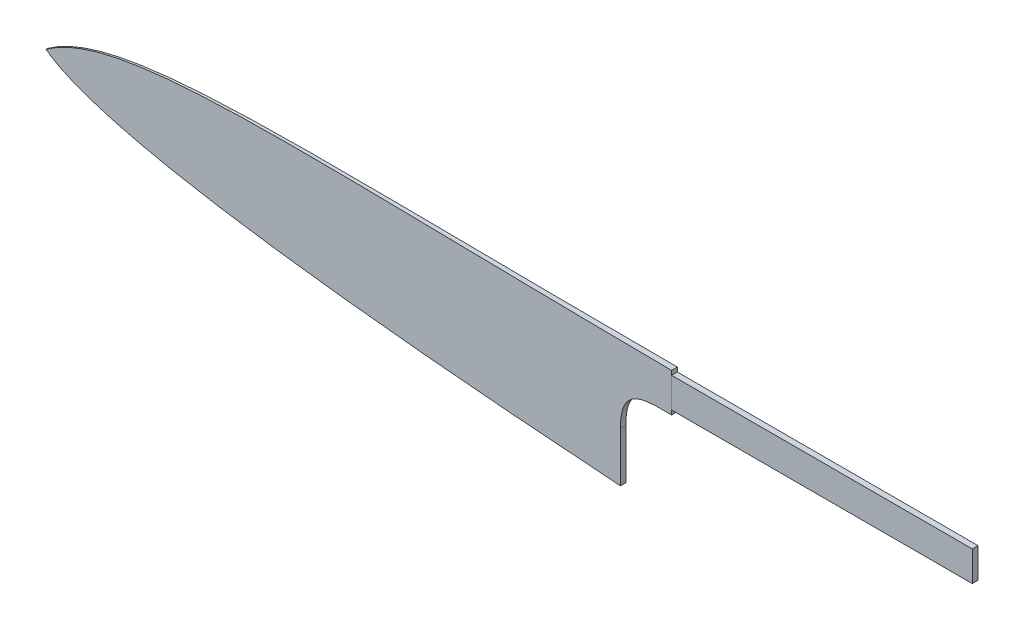
ISO-10303-21;
HEADER;
FILE_DESCRIPTION(('STEP AP214'),'2;1');
FILE_NAME('part.step','',(''),(''),'','','');
FILE_SCHEMA(('AUTOMOTIVE_DESIGN { 1 0 10303 214 1 1 1 1 }'));
ENDSEC;
DATA;
#1=APPLICATION_CONTEXT('core data for automotive mechanical design processes');
#2=APPLICATION_PROTOCOL_DEFINITION('international standard','automotive_design',2000,#1);
#3=PRODUCT_CONTEXT('',#1,'mechanical');
#4=PRODUCT('Part','Part','',(#3));
#5=PRODUCT_RELATED_PRODUCT_CATEGORY('part','',(#4));
#6=PRODUCT_DEFINITION_FORMATION('','',#4);
#7=PRODUCT_DEFINITION_CONTEXT('part definition',#1,'design');
#8=PRODUCT_DEFINITION('design','',#6,#7);
#9=PRODUCT_DEFINITION_SHAPE('','',#8);
#10=(LENGTH_UNIT() NAMED_UNIT(*) SI_UNIT(.MILLI.,.METRE.));
#11=(NAMED_UNIT(*) PLANE_ANGLE_UNIT() SI_UNIT($,.RADIAN.));
#12=(NAMED_UNIT(*) SI_UNIT($,.STERADIAN.) SOLID_ANGLE_UNIT());
#13=UNCERTAINTY_MEASURE_WITH_UNIT(LENGTH_MEASURE(1.E-05),#10,'distance_accuracy_value','');
#14=(GEOMETRIC_REPRESENTATION_CONTEXT(3) GLOBAL_UNCERTAINTY_ASSIGNED_CONTEXT((#13)) GLOBAL_UNIT_ASSIGNED_CONTEXT((#10,
#11,#12)) REPRESENTATION_CONTEXT('',''));
#15=CARTESIAN_POINT('',(0.,0.,0.));
#16=DIRECTION('',(0.,0.,1.));
#17=DIRECTION('',(1.,0.,0.));
#18=AXIS2_PLACEMENT_3D('',#15,#16,#17);
#19=CARTESIAN_POINT('',(0.,52.,0.500000000000042));
#20=DIRECTION('',(0.0068180233432412,0.,-0.999976757008727));
#21=DIRECTION('',(-0.999976757008727,0.,-0.0068180233432412));
#22=AXIS2_PLACEMENT_3D('',#19,#20,#21);
#23=PLANE('',#22);
#24=CARTESIAN_POINT('',(220.,34.5,2.00000000000002));
#25=CARTESIAN_POINT('',(219.705943450654,34.4999900263377,1.99799506898174));
#26=CARTESIAN_POINT('',(219.411887124813,34.5003581419151,1.99599013948738));
#27=CARTESIAN_POINT('',(218.823474040931,34.5010436281228,1.99197823209727));
#28=CARTESIAN_POINT('',(218.529117282854,34.50136094653,1.98997125420129));
#29=CARTESIAN_POINT('',(217.940222914986,34.501134564733,1.98595606532946));
#30=CARTESIAN_POINT('',(217.645685304876,34.5005903369271,1.98394785435144));
#31=CARTESIAN_POINT('',(217.056548702735,34.4977408189894,1.9799310138823));
#32=CARTESIAN_POINT('',(216.761949712249,34.4954351218858,1.97792238440171));
#33=CARTESIAN_POINT('',(216.166333686134,34.4879945398922,1.97386136604184));
#34=CARTESIAN_POINT('',(215.865317336315,34.4827988233492,1.97180898183853));
#35=CARTESIAN_POINT('',(215.263458904218,34.4683594578574,1.96770540161969));
#36=CARTESIAN_POINT('',(214.962616796778,34.4591169241271,1.96565420543259));
#37=CARTESIAN_POINT('',(214.361233504333,34.4352507816667,1.96155386480228));
#38=CARTESIAN_POINT('',(214.060692254255,34.4206288753846,1.95950471991539));
#39=CARTESIAN_POINT('',(213.460039491407,34.3844753084658,1.9554093601687));
#40=CARTESIAN_POINT('',(213.159927940106,34.362944312177,1.95336314504619));
#41=CARTESIAN_POINT('',(212.610765905609,34.3155438966368,1.94961885844735));
#42=CARTESIAN_POINT('',(212.361601654465,34.2910096608983,1.94792001128046));
#43=CARTESIAN_POINT('',(211.864049243434,34.2347573008229,1.94452760847797));
#44=CARTESIAN_POINT('',(211.615661157084,34.2030385155315,1.94283405334377));
#45=CARTESIAN_POINT('',(211.120030527538,34.1310927779367,1.93945475359687));
#46=CARTESIAN_POINT('',(210.872788334436,34.0908633807092,1.93776901137117));
#47=CARTESIAN_POINT('',(210.381343824899,34.0006528922389,1.9344182533516));
#48=CARTESIAN_POINT('',(210.137132492368,33.950721525294,1.93275317608434));
#49=CARTESIAN_POINT('',(209.651358543768,33.8393922670979,1.92944108098025));
#50=CARTESIAN_POINT('',(209.409795414744,33.7779966395478,1.927794059646));
#51=CARTESIAN_POINT('',(208.930466427999,33.6420514190386,1.92452590746364));
#52=CARTESIAN_POINT('',(208.692699065322,33.5675071880103,1.92290476635448));
#53=CARTESIAN_POINT('',(208.223566728578,33.4039496944126,1.91970613678577));
#54=CARTESIAN_POINT('',(207.992174396648,33.3150156215203,1.91812846179535));
#55=CARTESIAN_POINT('',(207.536314508856,33.120812461045,1.91502032619676));
#56=CARTESIAN_POINT('',(207.311846394438,33.0155446952003,1.91348986178028));
#57=CARTESIAN_POINT('',(206.872302988629,32.7875573409566,1.91049297492248));
#58=CARTESIAN_POINT('',(206.657214684714,32.6648630046813,1.90902646375943));
#59=CARTESIAN_POINT('',(206.238494373407,32.4012115673991,1.90617155254598));
#60=CARTESIAN_POINT('',(206.034861933933,32.2602551558483,1.90478314954957));
#61=CARTESIAN_POINT('',(205.639698694761,31.9588376679743,1.90208885473703));
#62=CARTESIAN_POINT('',(205.448289958908,31.7982160832599,1.90078379517439));
#63=CARTESIAN_POINT('',(205.081649347262,31.4594656025268,1.89828397282226));
#64=CARTESIAN_POINT('',(204.906417104598,31.2813371037414,1.89708920753137));
#65=CARTESIAN_POINT('',(204.573481959898,30.9092952471037,1.89481919518114));
#66=CARTESIAN_POINT('',(204.415785426408,30.7153761985079,1.89374399154371));
#67=CARTESIAN_POINT('',(204.118555127804,30.3141042786515,1.89171742132595));
#68=CARTESIAN_POINT('',(203.979023816677,30.106749597991,1.89076607147736));
#69=CARTESIAN_POINT('',(203.692505499547,29.6396514306856,1.88881253749693));
#70=CARTESIAN_POINT('',(203.549346821812,29.3775625744421,1.88783645560328));
#71=CARTESIAN_POINT('',(203.287108280717,28.8416388204328,1.88604846555036));
#72=CARTESIAN_POINT('',(203.168035723706,28.5678003889604,1.8852366072071));
#73=CARTESIAN_POINT('',(202.951027286145,28.009830378534,1.88375700422373));
#74=CARTESIAN_POINT('',(202.85323926827,27.7256418658249,1.88309026773822));
#75=CARTESIAN_POINT('',(202.677324665967,27.1513468019386,1.88189084999525));
#76=CARTESIAN_POINT('',(202.599196162811,26.8612408312827,1.88135815565556));
#77=CARTESIAN_POINT('',(202.461419937903,26.2823022704362,1.88041877230392));
#78=CARTESIAN_POINT('',(202.401461780621,25.9935425783977,1.88000996668607));
#79=CARTESIAN_POINT('',(202.296030126808,25.4132967515089,1.87929111450097));
#80=CARTESIAN_POINT('',(202.250562899882,25.1218094925474,1.87898111068103));
#81=CARTESIAN_POINT('',(202.172287972169,24.5369566711788,1.87844741799208));
#82=CARTESIAN_POINT('',(202.139489233042,24.2435899278193,1.8782237902253));
#83=CARTESIAN_POINT('',(202.085661531322,23.6627601879368,1.87785678316812));
#84=CARTESIAN_POINT('',(202.064373740822,23.3753207362962,1.87771163914198));
#85=CARTESIAN_POINT('',(202.031159401762,22.8001683738834,1.8774851777393));
#86=CARTESIAN_POINT('',(202.019224723884,22.5124559186792,1.87740380493559));
#87=CARTESIAN_POINT('',(202.003668926905,21.9374958000225,1.87729774268346));
#88=CARTESIAN_POINT('',(202.000027827363,21.650248689058,1.87727291700476));
#89=CARTESIAN_POINT('',(202.,21.3630331505771,1.87727272727274));
#90=B_SPLINE_CURVE_WITH_KNOTS('',3,(#24,#25,#26,#27,#28,#29,#30,#31,#32,#33,#34,#35,#36,#37,#38,
#39,#40,#41,#42,#43,#44,#45,#46,#47,#48,#49,#50,#51,#52,#53,#54,#55,#56,#57,#58,#59,#60,#61,#62,
#63,#64,#65,#66,#67,#68,#69,#70,#71,#72,#73,#74,#75,#76,#77,#78,#79,#80,#81,#82,#83,#84,#85,#86,
#87,#88,#89),.UNSPECIFIED.,.F.,.F.,(4,2,2,2,2,2,2,2,2,2,2,2,2,2,2,2,2,2,2,2,2,2,2,2,2,2,2,2,2,2,
2,2,4),(0.,0.882190002111462,1.76528121380216,2.64891343039098,3.53274986409533,4.435935277913,
5.33887194916582,6.24152310716143,7.14408749617821,7.8951273433212,8.64623631170646,
9.39756135201356,10.1451327200139,10.8925566304494,11.6396764470901,12.3828164636837,
13.1258963759974,13.8679103039605,14.6098962265084,15.358402168448,16.1068911306458,
16.8556510442823,17.6045120051455,18.4990257277843,19.3938103891184,20.2946255959574,
21.1953528510166,22.0796889094848,22.9644070644684,23.8497499258287,24.7142568217189,
25.5780114898632,26.4396830359918),.UNSPECIFIED.);
#91=CARTESIAN_POINT('',(220.,34.5,2.00000000000001));
#92=VERTEX_POINT('',#91);
#93=CARTESIAN_POINT('',(202.,21.3630331505771,1.87727272727273));
#94=VERTEX_POINT('',#93);
#95=EDGE_CURVE('E106',#92,#94,#90,.T.);
#96=ORIENTED_EDGE('',*,*,#95,.F.);
#97=DIRECTION('',(0.,1.,0.));
#98=VECTOR('',#97,1.);
#99=CARTESIAN_POINT('',(220.,36.,2.00000000000001));
#100=LINE('',#99,#98);
#101=CARTESIAN_POINT('',(220.,36.,2.00000000000001));
#102=VERTEX_POINT('',#101);
#103=EDGE_CURVE('E116',#92,#102,#100,.T.);
#104=ORIENTED_EDGE('',*,*,#103,.T.);
#105=DIRECTION('',(0.,-1.,0.));
#106=VECTOR('',#105,1.);
#107=CARTESIAN_POINT('',(220.,52.,2.00000000000001));
#108=LINE('',#107,#106);
#109=CARTESIAN_POINT('',(220.,46.5,2.00000000000001));
#110=VERTEX_POINT('',#109);
#111=EDGE_CURVE('E226',#110,#102,#108,.T.);
#112=ORIENTED_EDGE('',*,*,#111,.F.);
#113=DIRECTION('',(0.,1.,0.));
#114=VECTOR('',#113,1.);
#115=CARTESIAN_POINT('',(220.,46.5,2.00000000000001));
#116=LINE('',#115,#114);
#117=CARTESIAN_POINT('',(220.,48.,2.00000000000001));
#118=VERTEX_POINT('',#117);
#119=EDGE_CURVE('E124',#110,#118,#116,.T.);
#120=ORIENTED_EDGE('',*,*,#119,.T.);
#121=CARTESIAN_POINT('',(0.,34.3739398129274,0.500000000000042));
#122=CARTESIAN_POINT('',(0.524867259545,34.7554897413912,0.50357864040603));
#123=CARTESIAN_POINT('',(1.0589926230277,35.1241443307954,0.507220404247958));
#124=CARTESIAN_POINT('',(2.1408711121908,35.834641114132,0.514596848492251));
#125=CARTESIAN_POINT('',(2.68853992825894,36.1766115664871,0.518330954056352));
#126=CARTESIAN_POINT('',(3.79621750407102,36.8355308468651,0.525883301164162));
#127=CARTESIAN_POINT('',(4.35617911579209,37.1525591805863,0.529701221244078));
#128=CARTESIAN_POINT('',(5.4872447810945,37.7633628612964,0.537413032598413));
#129=CARTESIAN_POINT('',(6.05832564947798,38.0571812330182,0.541306765791936));
#130=CARTESIAN_POINT('',(7.21048882342137,38.6232050261574,0.549162423796095));
#131=CARTESIAN_POINT('',(7.79156249683609,38.8954280633496,0.553124289751196));
#132=CARTESIAN_POINT('',(8.96263238916208,39.4198015792233,0.561108857198873));
#133=CARTESIAN_POINT('',(9.55262805423056,39.6719532978176,0.565131554915249));
#134=CARTESIAN_POINT('',(10.7309091328242,40.1536910943395,0.573165289542024));
#135=CARTESIAN_POINT('',(11.3190751401674,40.3835700203211,0.577175512319363));
#136=CARTESIAN_POINT('',(12.5021702060925,40.8265786835943,0.585242069587035));
#137=CARTESIAN_POINT('',(13.0971040122039,41.0396957119996,0.589298436446885));
#138=CARTESIAN_POINT('',(14.2928303011874,41.4503546236946,0.597451115689954));
#139=CARTESIAN_POINT('',(14.8936270042411,41.6478841887827,0.601547456847138));
#140=CARTESIAN_POINT('',(16.1002016482384,42.0284576170252,0.60977410214712));
#141=CARTESIAN_POINT('',(16.7059825260667,42.211492145988,0.613904426314131));
#142=CARTESIAN_POINT('',(17.9216735473252,42.5640878292805,0.622193228731802));
#143=CARTESIAN_POINT('',(18.531585057383,42.7336442616823,0.626351716300377));
#144=CARTESIAN_POINT('',(19.7547026582445,43.0602199735409,0.634691154488071));
#145=CARTESIAN_POINT('',(20.3679085394142,43.2172400408837,0.638872103677866));
#146=CARTESIAN_POINT('',(21.9584658159616,43.6086149512296,0.6497168123816));
#147=CARTESIAN_POINT('',(22.9379873665342,43.834173392118,0.656395368408228));
#148=CARTESIAN_POINT('',(24.9026337872248,44.2595726065643,0.669790684912934));
#149=CARTESIAN_POINT('',(25.887759095975,44.4594113371716,0.676507448381686));
#150=CARTESIAN_POINT('',(27.8621337748799,44.8363187614828,0.689969093919674));
#151=CARTESIAN_POINT('',(28.8513822848155,45.0133919811171,0.69671397012378));
#152=CARTESIAN_POINT('',(30.8332255995135,45.3474324034732,0.710226538178539));
#153=CARTESIAN_POINT('',(31.8258203255164,45.5044000760721,0.716994229492195));
#154=CARTESIAN_POINT('',(33.8146416279079,45.8006671791662,0.730554374735773));
#155=CARTESIAN_POINT('',(34.8108708386328,45.939948838076,0.737346846627079));
#156=CARTESIAN_POINT('',(36.8054121873724,46.2026596482989,0.750945992186667));
#157=CARTESIAN_POINT('',(37.8037243363272,46.3260887161369,0.75775266592954));
#158=CARTESIAN_POINT('',(39.8030669424519,46.5589640701398,0.771384547334936));
#159=CARTESIAN_POINT('',(40.8040991730638,46.6683950573138,0.778209767089108));
#160=CARTESIAN_POINT('',(42.8074534919018,46.874647474913,0.791869001081185));
#161=CARTESIAN_POINT('',(43.8097755775815,46.9714689301921,0.798703015301729));
#162=CARTESIAN_POINT('',(45.8160476502343,47.153901449752,0.812382143069816));
#163=CARTESIAN_POINT('',(46.8199982556738,47.2395056836908,0.819227260834175));
#164=CARTESIAN_POINT('',(48.8287128564522,47.4006111358625,0.832923042203119));
#165=CARTESIAN_POINT('',(49.8334768586953,47.4761122674149,0.839773705854776));
#166=CARTESIAN_POINT('',(52.8483463962609,47.6890313432836,0.860329634519996));
#167=CARTESIAN_POINT('',(54.8594140504268,47.8128990891734,0.874041459434763));
#168=CARTESIAN_POINT('',(58.9426481514436,48.0347138615249,0.901881691941696));
#169=CARTESIAN_POINT('',(61.0148608284393,48.131784947769,0.916010414739393));
#170=CARTESIAN_POINT('',(65.1580748920871,48.3008795525138,0.944259601536991));
#171=CARTESIAN_POINT('',(67.2290752106982,48.3729296962814,0.958380058254794));
#172=CARTESIAN_POINT('',(71.3701569752231,48.4968118549663,0.986614706649281));
#173=CARTESIAN_POINT('',(73.4402379927882,48.5486585475303,1.00072889540541));
#174=CARTESIAN_POINT('',(77.5797976742223,48.6359850921205,1.02895316596064));
#175=CARTESIAN_POINT('',(79.6492761857302,48.6714723531714,1.04306324672092));
#176=CARTESIAN_POINT('',(83.787959968603,48.7291918003134,1.07128154524051));
#177=CARTESIAN_POINT('',(85.8571652009389,48.7514268794851,1.08538976273371));
#178=CARTESIAN_POINT('',(89.9956437458931,48.7851838023612,1.11360666190384));
#179=CARTESIAN_POINT('',(92.0649170578857,48.7967057262654,1.12771534357651));
#180=CARTESIAN_POINT('',(95.9348101638773,48.8101896109367,1.15410097839009));
#181=CARTESIAN_POINT('',(97.735426681645,48.8131986094803,1.16637790919306));
#182=CARTESIAN_POINT('',(101.33666147266,48.8138460102669,1.19093178276817));
#183=CARTESIAN_POINT('',(103.137279745907,48.8114844076163,1.2032087255403));
#184=CARTESIAN_POINT('',(106.739012124349,48.8023898734379,1.22776599175695));
#185=CARTESIAN_POINT('',(108.540126226206,48.7956557096442,1.24004631517871));
#186=CARTESIAN_POINT('',(112.142338176381,48.7786707091407,1.26460685120262));
#187=CARTESIAN_POINT('',(113.943436024689,48.7684198707799,1.27688706380472));
#188=CARTESIAN_POINT('',(119.347569804583,48.7335327648509,1.31373343048582));
#189=CARTESIAN_POINT('',(122.95057857831,48.7047648542998,1.33829939939759));
#190=CARTESIAN_POINT('',(130.157201105024,48.6410819061354,1.38743546207973));
#191=CARTESIAN_POINT('',(133.760814847381,48.6061657387432,1.41200555577762));
#192=CARTESIAN_POINT('',(140.968450511129,48.533866420732,1.46114852621227));
#193=CARTESIAN_POINT('',(144.572472429501,48.4964829739981,1.48572140292844));
#194=CARTESIAN_POINT('',(151.780718696582,48.4221124125188,1.53486853656763));
#195=CARTESIAN_POINT('',(155.384943045518,48.3851253196923,1.55944279349219));
#196=CARTESIAN_POINT('',(162.379717453062,48.315889875679,1.60713443717999));
#197=CARTESIAN_POINT('',(165.770265991078,48.2834905848437,1.63025181357556));
#198=CARTESIAN_POINT('',(172.551178308221,48.2224793621711,1.67648530664698));
#199=CARTESIAN_POINT('',(175.941542085113,48.1938671855101,1.69960142330761));
#200=CARTESIAN_POINT('',(182.721907057306,48.1416040888618,1.74583118448165));
#201=CARTESIAN_POINT('',(186.111908248021,48.1179525820094,1.7689448289638));
#202=CARTESIAN_POINT('',(192.891368733463,48.0765468542535,1.81516842318272));
#203=CARTESIAN_POINT('',(196.280828021972,48.0587916279555,1.8382783728771));
#204=CARTESIAN_POINT('',(203.059024565883,48.0299355122267,1.88449334931285));
#205=CARTESIAN_POINT('',(206.447761814882,48.0188331494077,1.90759837601057));
#206=CARTESIAN_POINT('',(213.224332272012,48.0038555609605,1.953802265491));
#207=CARTESIAN_POINT('',(216.612165475865,47.9999783744952,1.97690112824455));
#208=CARTESIAN_POINT('',(220.,48.,2.00000000000002));
#209=B_SPLINE_CURVE_WITH_KNOTS('',3,(#121,#122,#123,#124,#125,#126,#127,#128,#129,#130,#131,
#132,#133,#134,#135,#136,#137,#138,#139,#140,#141,#142,#143,#144,#145,#146,#147,#148,#149,#150,
#151,#152,#153,#154,#155,#156,#157,#158,#159,#160,#161,#162,#163,#164,#165,#166,#167,#168,#169,
#170,#171,#172,#173,#174,#175,#176,#177,#178,#179,#180,#181,#182,#183,#184,#185,#186,#187,#188,
#189,#190,#191,#192,#193,#194,#195,#196,#197,#198,#199,#200,#201,#202,#203,#204,#205,#206,#207,
#208),.UNSPECIFIED.,.F.,.F.,(4,2,2,2,2,2,2,2,2,2,2,2,2,2,2,2,2,2,2,2,2,2,2,2,2,2,2,2,2,2,2,2,2,
2,2,2,2,2,2,2,2,2,2,4),(0.,1.94638737722095,3.88275489943525,5.81267638104154,7.73893201578364,
9.6635998506926,11.5881486961474,13.4823873977529,15.3780487383989,17.27519345282,
19.17355007874,21.0725688719141,22.9714682213844,25.9865753415,29.0019218079404,
32.0166678739921,35.0313434709909,38.0490247533372,41.0667219252611,44.0876895650521,
47.1086512502602,50.1314439819071,53.1542626462418,59.1987418377799,65.4221665065405,
71.6389482692028,77.8512051314184,84.0606457532751,90.2687302965843,96.4767683651177,
101.878741859594,107.280720276376,112.684221728488,118.087725717522,128.897335936203,
139.708934562082,150.521833128983,161.335326607407,171.507671632196,181.679358728789,
191.849841798617,202.018589773648,212.185084875789,222.3488204958),.UNSPECIFIED.);
#210=CARTESIAN_POINT('',(0.,34.3739398129274,0.500000000000042));
#211=VERTEX_POINT('',#210);
#212=EDGE_CURVE('E132',#211,#118,#209,.T.);
#213=ORIENTED_EDGE('',*,*,#212,.F.);
#214=CARTESIAN_POINT('',(202.,4.,1.87727272727275));
#215=CARTESIAN_POINT('',(199.054947257436,4.17989799883231,1.85719282220981));
#216=CARTESIAN_POINT('',(196.110121557456,4.36353971667272,1.83711446516449));
#217=CARTESIAN_POINT('',(190.220814088698,4.73887221062313,1.79696009605932));
#218=CARTESIAN_POINT('',(187.276332349265,4.93056344697199,1.77688408419956));
#219=CARTESIAN_POINT('',(181.387826591583,5.32254366676886,1.73673518130626));
#220=CARTESIAN_POINT('',(178.443802595308,5.52283298080028,1.71666229042257));
#221=CARTESIAN_POINT('',(172.556332936182,5.93264247104948,1.67652045183762));
#222=CARTESIAN_POINT('',(169.612887287107,6.14216284538638,1.6564515042303));
#223=CARTESIAN_POINT('',(163.726699806172,6.5711444198264,1.61631840776938));
#224=CARTESIAN_POINT('',(160.783957979141,6.79060568627446,1.59625425894871));
#225=CARTESIAN_POINT('',(154.914987044993,7.23907882224997,1.55623854803406));
#226=CARTESIAN_POINT('',(151.988753574289,7.46803351309637,1.53628695618836));
#227=CARTESIAN_POINT('',(146.137243507351,7.93748625179805,1.49639029664105));
#228=CARTESIAN_POINT('',(143.211966901034,8.17798417382038,1.47644522887071));
#229=CARTESIAN_POINT('',(137.362516427832,8.67156942712696,1.43656261200797));
#230=CARTESIAN_POINT('',(134.438342545742,8.9246565779176,1.4166250628119));
#231=CARTESIAN_POINT('',(128.591258553291,9.44463560240238,1.37675858104519));
#232=CARTESIAN_POINT('',(125.668348427182,9.71152729876028,1.35682964836718));
#233=CARTESIAN_POINT('',(119.823968047511,10.2605370782551,1.31698160032397));
#234=CARTESIAN_POINT('',(116.902497787234,10.5426550896933,1.29706248491299));
#235=CARTESIAN_POINT('',(112.065194084828,11.023924744694,1.26408086876022));
#236=CARTESIAN_POINT('',(110.148880883485,11.2182604088827,1.25101509693288));
#237=CARTESIAN_POINT('',(106.317059785844,11.6147753289897,1.22488904399442));
#238=CARTESIAN_POINT('',(104.401551891661,11.8169546053845,1.21182876289772));
#239=CARTESIAN_POINT('',(100.571440460423,12.2297805209649,1.18571436677564));
#240=CARTESIAN_POINT('',(98.6568369268371,12.4404271923695,1.17266025177392));
#241=CARTESIAN_POINT('',(94.8286423314048,12.870901320072,1.14655892498688));
#242=CARTESIAN_POINT('',(92.9150512794336,13.090728864304,1.1335117132689));
#243=CARTESIAN_POINT('',(89.0890015232544,13.5403840649637,1.10742501038586));
#244=CARTESIAN_POINT('',(87.1765428440451,13.7702119343896,1.09438551939125));
#245=CARTESIAN_POINT('',(83.3451092302998,14.2417748918023,1.06826210838844));
#246=CARTESIAN_POINT('',(81.4261398345057,14.4835550526199,1.05517822614439));
#247=CARTESIAN_POINT('',(77.5897592705774,14.9792614824754,1.02902108593579));
#248=CARTESIAN_POINT('',(75.6723481093509,15.2331878050625,1.01594782801833));
#249=CARTESIAN_POINT('',(71.839381314978,15.7544958718042,0.989813963511247));
#250=CARTESIAN_POINT('',(69.9238256544063,16.0218774138916,0.976753356734621));
#251=CARTESIAN_POINT('',(66.0949042762281,16.5716622841001,0.95064707461068));
#252=CARTESIAN_POINT('',(64.1815385181793,16.8540653300821,0.937601398987621));
#253=CARTESIAN_POINT('',(60.357369917842,17.4357862629668,0.911527522167138));
#254=CARTESIAN_POINT('',(58.4465670753262,17.7351041483694,0.898499320968166));
#255=CARTESIAN_POINT('',(55.4036264547961,18.2274948158467,0.877751998555462));
#256=CARTESIAN_POINT('',(54.2704787790088,18.4143366025485,0.870025991675095));
#257=CARTESIAN_POINT('',(52.0054178738554,18.7953959511646,0.854582394594504));
#258=CARTESIAN_POINT('',(50.8735046488989,18.9896135393382,0.846864804424346));
#259=CARTESIAN_POINT('',(48.6110884803942,19.3860865957827,0.831439239639087));
#260=CARTESIAN_POINT('',(47.4805855328508,19.58834204123,0.823731264996746));
#261=CARTESIAN_POINT('',(45.2211844659092,20.0016632158071,0.808326257722145));
#262=CARTESIAN_POINT('',(44.0922863526776,20.2127289786963,0.800629225131929));
#263=CARTESIAN_POINT('',(41.8363139082436,20.6445757726019,0.78524759482897));
#264=CARTESIAN_POINT('',(40.7092396293281,20.865357077207,0.777562997472728));
#265=CARTESIAN_POINT('',(38.457164033851,21.3177080382578,0.762207936594476));
#266=CARTESIAN_POINT('',(37.3321628831185,21.5492785218405,0.754537474203118));
#267=CARTESIAN_POINT('',(35.0928095263529,22.0227437268817,0.739269155861535));
#268=CARTESIAN_POINT('',(33.9784390572708,22.264551890153,0.73167117539052));
#269=CARTESIAN_POINT('',(31.752649704174,22.7615348235136,0.716495338892133));
#270=CARTESIAN_POINT('',(30.641230886457,23.016709891216,0.70891748331679));
#271=CARTESIAN_POINT('',(28.4219988145881,23.5422462763033,0.693786355554048));
#272=CARTESIAN_POINT('',(27.314185497707,23.8126073279695,0.68623308293895));
#273=CARTESIAN_POINT('',(25.1029410824771,24.3708022495835,0.671156416471473));
#274=CARTESIAN_POINT('',(23.9995100498541,24.6586363805473,0.663633023067224));
#275=CARTESIAN_POINT('',(21.7979417914018,25.2547041993539,0.648622330395962));
#276=CARTESIAN_POINT('',(20.6998054577544,25.5629412045849,0.641135037212007));
#277=CARTESIAN_POINT('',(19.0576214633399,26.0434827534539,0.629938328159172));
#278=CARTESIAN_POINT('',(18.5109198101899,26.2067398028265,0.626210816887688));
#279=CARTESIAN_POINT('',(17.4195457374783,26.5398931777298,0.61876963002831));
#280=CARTESIAN_POINT('',(16.874873290974,26.7097894147616,0.615055954256715));
#281=CARTESIAN_POINT('',(15.8558569172625,27.0351874000962,0.608108115345042));
#282=CARTESIAN_POINT('',(15.3812390729226,27.1898309992202,0.604872084588157));
#283=CARTESIAN_POINT('',(14.4340543778073,27.5052479883053,0.598414007121445));
#284=CARTESIAN_POINT('',(13.9614874761716,27.6660212252819,0.595191960064844));
#285=CARTESIAN_POINT('',(13.0188585311311,27.9942601445761,0.588764944530482));
#286=CARTESIAN_POINT('',(12.5487956971466,28.1617235529339,0.585559970662404));
#287=CARTESIAN_POINT('',(11.611666640033,28.5040118738894,0.579170454363901));
#288=CARTESIAN_POINT('',(11.1445988149992,28.67883239254,0.575985901011398));
#289=CARTESIAN_POINT('',(10.2140003665337,29.0366385494046,0.569640911590043));
#290=CARTESIAN_POINT('',(9.75046733246098,29.2196179045592,0.566480459085002));
#291=CARTESIAN_POINT('',(8.82754216728963,29.5947209344366,0.560187787504288));
#292=CARTESIAN_POINT('',(8.36814699862665,29.7868371168404,0.55705554771795));
#293=CARTESIAN_POINT('',(7.44988776268123,30.1832809168371,0.550794689291049));
#294=CARTESIAN_POINT('',(6.99106323632333,30.387700387163,0.5476663402477));
#295=CARTESIAN_POINT('',(6.0790500339582,30.8087150789878,0.541448068413392));
#296=CARTESIAN_POINT('',(5.62586098320892,31.0253094855455,0.538358143067375));
#297=CARTESIAN_POINT('',(4.72625296385219,31.4726548530743,0.532224452026306));
#298=CARTESIAN_POINT('',(4.27983706485279,31.703412006908,0.529180707260401));
#299=CARTESIAN_POINT('',(3.39519272435034,32.1816819518466,0.52314904130243));
#300=CARTESIAN_POINT('',(2.95697654474487,32.4292176195878,0.520161203714211));
#301=CARTESIAN_POINT('',(2.30764200612244,32.8155065306588,0.515733922769058));
#302=CARTESIAN_POINT('',(2.09218833631004,32.9469909260259,0.514264920474883));
#303=CARTESIAN_POINT('',(1.66465084131522,33.2153127878929,0.511349892099918));
#304=CARTESIAN_POINT('',(1.4525668004847,33.352149909875,0.509903864548801));
#305=CARTESIAN_POINT('',(1.03096955516882,33.6325631199282,0.507029337876193));
#306=CARTESIAN_POINT('',(0.821480768931946,33.7761760448275,0.505601005242759));
#307=CARTESIAN_POINT('',(0.407101031441075,34.0699793113787,0.502775688850776));
#308=CARTESIAN_POINT('',(0.202211144340338,34.220171152093,0.501378712347817));
#309=CARTESIAN_POINT('',(0.,34.3739398129274,0.500000000000043));
#310=B_SPLINE_CURVE_WITH_KNOTS('',3,(#214,#215,#216,#217,#218,#219,#220,#221,#222,#223,#224,
#225,#226,#227,#228,#229,#230,#231,#232,#233,#234,#235,#236,#237,#238,#239,#240,#241,#242,#243,
#244,#245,#246,#247,#248,#249,#250,#251,#252,#253,#254,#255,#256,#257,#258,#259,#260,#261,#262,
#263,#264,#265,#266,#267,#268,#269,#270,#271,#272,#273,#274,#275,#276,#277,#278,#279,#280,#281,
#282,#283,#284,#285,#286,#287,#288,#289,#290,#291,#292,#293,#294,#295,#296,#297,#298,#299,#300,
#301,#302,#303,#304,#305,#306,#307,#308,#309),.UNSPECIFIED.,.F.,.F.,(4,2,2,2,2,2,2,2,2,2,2,2,2,
2,2,2,2,2,2,2,2,2,2,2,2,2,2,2,2,2,2,2,2,2,2,2,2,2,2,2,2,2,2,2,2,2,2,4),(0.,8.85183143335083,
17.7041696695006,26.5568485703823,35.4097175621307,44.2626456461344,53.0683583537912,
61.8739750920223,70.679465619215,79.4848430572214,88.2901790354695,94.0687237715061,
99.8472835939707,105.625865406322,111.404502578397,117.18326289066,122.985783390103,
128.788329473688,134.590788441985,140.393138464942,146.195487973302,149.640890388376,
153.086305070862,156.531709970727,159.977128073871,163.422643261807,166.868423031259,
170.289337937973,173.710329043483,177.131260308357,180.552242688277,183.973782672799,
185.685457130862,187.397108780485,188.894631474776,190.392116818089,191.889097432431,
193.385196340132,194.88016236673,196.373922955413,197.880705297335,199.387386901153,
200.89473208262,202.404175481024,203.161339482061,203.91845482965,204.680311710851,
205.442343100005),.UNSPECIFIED.);
#311=CARTESIAN_POINT('',(202.,4.,1.87727272727275));
#312=VERTEX_POINT('',#311);
#313=EDGE_CURVE('E41',#312,#211,#310,.T.);
#314=ORIENTED_EDGE('',*,*,#313,.F.);
#315=DIRECTION('',(0.,-1.,0.));
#316=VECTOR('',#315,1.);
#317=CARTESIAN_POINT('',(202.,52.,1.87727272727274));
#318=LINE('',#317,#316);
#319=EDGE_CURVE('E11',#94,#312,#318,.T.);
#320=ORIENTED_EDGE('',*,*,#319,.F.);
#321=EDGE_LOOP('',(#96,#104,#112,#120,#213,#314,#320));
#322=FACE_BOUND('',#321,.T.);
#323=ADVANCED_FACE('F33',(#322),#23,.F.);
#324=CARTESIAN_POINT('',(220.,52.,2.00000000000001));
#325=DIRECTION('',(0.,0.,-1.));
#326=DIRECTION('',(-1.,0.,0.));
#327=AXIS2_PLACEMENT_3D('',#324,#325,#326);
#328=PLANE('',#327);
#329=DIRECTION('',(-1.,0.,0.));
#330=VECTOR('',#329,1.);
#331=CARTESIAN_POINT('',(325.,46.5,2.00000000000001));
#332=LINE('',#331,#330);
#333=CARTESIAN_POINT('',(325.,46.5,2.00000000000001));
#334=VERTEX_POINT('',#333);
#335=EDGE_CURVE('E165',#334,#110,#332,.T.);
#336=ORIENTED_EDGE('',*,*,#335,.T.);
#337=ORIENTED_EDGE('',*,*,#111,.T.);
#338=DIRECTION('',(1.,0.,0.));
#339=VECTOR('',#338,1.);
#340=CARTESIAN_POINT('',(325.,36.,2.00000000000001));
#341=LINE('',#340,#339);
#342=CARTESIAN_POINT('',(325.,36.,2.00000000000001));
#343=VERTEX_POINT('',#342);
#344=EDGE_CURVE('E123',#102,#343,#341,.T.);
#345=ORIENTED_EDGE('',*,*,#344,.T.);
#346=DIRECTION('',(0.,1.,0.));
#347=VECTOR('',#346,1.);
#348=CARTESIAN_POINT('',(325.,46.5,2.00000000000001));
#349=LINE('',#348,#347);
#350=EDGE_CURVE('E175',#343,#334,#349,.T.);
#351=ORIENTED_EDGE('',*,*,#350,.T.);
#352=EDGE_LOOP('',(#336,#337,#345,#351));
#353=FACE_BOUND('',#352,.T.);
#354=ADVANCED_FACE('F217',(#353),#328,.F.);
#355=CARTESIAN_POINT('',(202.,4.,-50.));
#356=DIRECTION('',(1.,0.,0.));
#357=DIRECTION('',(0.,0.,-1.));
#358=AXIS2_PLACEMENT_3D('',#355,#356,#357);
#359=PLANE('',#358);
#360=DIRECTION('',(0.,1.,0.));
#361=VECTOR('',#360,1.);
#362=CARTESIAN_POINT('',(202.,52.,-8.69018688759541E-13));
#363=LINE('',#362,#361);
#364=CARTESIAN_POINT('',(202.,4.,0.));
#365=VERTEX_POINT('',#364);
#366=CARTESIAN_POINT('',(202.,21.3630331505771,-8.81239525796218E-13));
#367=VERTEX_POINT('',#366);
#368=EDGE_CURVE('E230',#365,#367,#363,.T.);
#369=ORIENTED_EDGE('',*,*,#368,.T.);
#370=DIRECTION('',(0.,0.,1.));
#371=VECTOR('',#370,1.);
#372=CARTESIAN_POINT('',(202.,21.3630331505771,-50.));
#373=LINE('',#372,#371);
#374=EDGE_CURVE('E113',#367,#94,#373,.T.);
#375=ORIENTED_EDGE('',*,*,#374,.T.);
#376=ORIENTED_EDGE('',*,*,#319,.T.);
#377=DIRECTION('',(0.,0.,1.));
#378=VECTOR('',#377,1.);
#379=CARTESIAN_POINT('',(202.,4.,-50.));
#380=LINE('',#379,#378);
#381=EDGE_CURVE('E185',#365,#312,#380,.T.);
#382=ORIENTED_EDGE('',*,*,#381,.F.);
#383=EDGE_LOOP('',(#369,#375,#376,#382));
#384=FACE_BOUND('',#383,.T.);
#385=ADVANCED_FACE('F154',(#384),#359,.T.);
#386=CARTESIAN_POINT('',(0.,34.3739398129274,-50.));
#387=CARTESIAN_POINT('',(25.7823416487105,14.7635886369106,-50.));
#388=CARTESIAN_POINT('',(202.,4.,-50.));
#389=B_SPLINE_CURVE_WITH_KNOTS('',2,(#386,#387,#388),.UNSPECIFIED.,.F.,.F.,(3,3),(0.,1.),.UNSPECIFIED.);
#390=DIRECTION('',(0.,0.,1.));
#391=VECTOR('',#390,1.);
#392=SURFACE_OF_LINEAR_EXTRUSION('',#389,#391);
#393=CARTESIAN_POINT('',(0.,34.3739398129274,0.));
#394=CARTESIAN_POINT('',(25.7823416487105,14.7635886369106,0.));
#395=CARTESIAN_POINT('',(202.,4.,0.));
#396=B_SPLINE_CURVE_WITH_KNOTS('',2,(#393,#394,#395),.UNSPECIFIED.,.F.,.F.,(3,3),(0.,1.),.UNSPECIFIED.);
#397=CARTESIAN_POINT('',(0.,34.3739398129274,0.));
#398=VERTEX_POINT('',#397);
#399=EDGE_CURVE('E232',#398,#365,#396,.T.);
#400=ORIENTED_EDGE('',*,*,#399,.T.);
#401=ORIENTED_EDGE('',*,*,#381,.T.);
#402=ORIENTED_EDGE('',*,*,#313,.T.);
#403=DIRECTION('',(0.,0.,1.));
#404=VECTOR('',#403,1.);
#405=CARTESIAN_POINT('',(0.,34.3739398129274,-50.));
#406=LINE('',#405,#404);
#407=EDGE_CURVE('E188',#398,#211,#406,.T.);
#408=ORIENTED_EDGE('',*,*,#407,.F.);
#409=EDGE_LOOP('',(#400,#401,#402,#408));
#410=FACE_BOUND('',#409,.T.);
#411=ADVANCED_FACE('F203',(#410),#392,.T.);
#412=CARTESIAN_POINT('',(325.,46.5,-50.));
#413=DIRECTION('',(0.,1.,0.));
#414=DIRECTION('',(0.,0.,1.));
#415=AXIS2_PLACEMENT_3D('',#412,#413,#414);
#416=PLANE('',#415);
#417=DIRECTION('',(-1.,0.,0.));
#418=VECTOR('',#417,1.);
#419=CARTESIAN_POINT('',(0.,46.5,0.));
#420=LINE('',#419,#418);
#421=CARTESIAN_POINT('',(325.,46.5,-1.40859546249317E-12));
#422=VERTEX_POINT('',#421);
#423=CARTESIAN_POINT('',(220.,46.5,-9.46455997658905E-13));
#424=VERTEX_POINT('',#423);
#425=EDGE_CURVE('E242',#422,#424,#420,.T.);
#426=ORIENTED_EDGE('',*,*,#425,.T.);
#427=DIRECTION('',(0.,0.,1.));
#428=VECTOR('',#427,1.);
#429=CARTESIAN_POINT('',(220.,46.5,-50.));
#430=LINE('',#429,#428);
#431=EDGE_CURVE('E48',#424,#110,#430,.T.);
#432=ORIENTED_EDGE('',*,*,#431,.T.);
#433=ORIENTED_EDGE('',*,*,#335,.F.);
#434=DIRECTION('',(0.,0.,1.));
#435=VECTOR('',#434,1.);
#436=CARTESIAN_POINT('',(325.,46.5,-50.));
#437=LINE('',#436,#435);
#438=EDGE_CURVE('E178',#422,#334,#437,.T.);
#439=ORIENTED_EDGE('',*,*,#438,.F.);
#440=EDGE_LOOP('',(#426,#432,#433,#439));
#441=FACE_BOUND('',#440,.T.);
#442=ADVANCED_FACE('F213',(#441),#416,.T.);
#443=CARTESIAN_POINT('',(325.,46.5,-50.));
#444=DIRECTION('',(1.,0.,0.));
#445=DIRECTION('',(0.,0.,-1.));
#446=AXIS2_PLACEMENT_3D('',#443,#444,#445);
#447=PLANE('',#446);
#448=DIRECTION('',(0.,1.,0.));
#449=VECTOR('',#448,1.);
#450=CARTESIAN_POINT('',(325.,52.,-1.3981736329052E-12));
#451=LINE('',#450,#449);
#452=CARTESIAN_POINT('',(325.,36.,-1.18655085756814E-12));
#453=VERTEX_POINT('',#452);
#454=EDGE_CURVE('E247',#453,#422,#451,.T.);
#455=ORIENTED_EDGE('',*,*,#454,.T.);
#456=ORIENTED_EDGE('',*,*,#438,.T.);
#457=ORIENTED_EDGE('',*,*,#350,.F.);
#458=DIRECTION('',(0.,0.,1.));
#459=VECTOR('',#458,1.);
#460=CARTESIAN_POINT('',(325.,36.,-50.));
#461=LINE('',#460,#459);
#462=EDGE_CURVE('E181',#453,#343,#461,.T.);
#463=ORIENTED_EDGE('',*,*,#462,.F.);
#464=EDGE_LOOP('',(#455,#456,#457,#463));
#465=FACE_BOUND('',#464,.T.);
#466=ADVANCED_FACE('F215',(#465),#447,.T.);
#467=CARTESIAN_POINT('',(325.,36.,-50.));
#468=DIRECTION('',(0.,-1.,0.));
#469=DIRECTION('',(1.,0.,0.));
#470=AXIS2_PLACEMENT_3D('',#467,#468,#469);
#471=PLANE('',#470);
#472=DIRECTION('',(1.,0.,0.));
#473=VECTOR('',#472,1.);
#474=CARTESIAN_POINT('',(0.,36.,0.));
#475=LINE('',#474,#473);
#476=CARTESIAN_POINT('',(220.,36.,-9.57567358739198E-13));
#477=VERTEX_POINT('',#476);
#478=EDGE_CURVE('E249',#477,#453,#475,.T.);
#479=ORIENTED_EDGE('',*,*,#478,.T.);
#480=ORIENTED_EDGE('',*,*,#462,.T.);
#481=ORIENTED_EDGE('',*,*,#344,.F.);
#482=DIRECTION('',(0.,0.,1.));
#483=VECTOR('',#482,1.);
#484=CARTESIAN_POINT('',(220.,36.,-50.));
#485=LINE('',#484,#483);
#486=EDGE_CURVE('E112',#477,#102,#485,.T.);
#487=ORIENTED_EDGE('',*,*,#486,.F.);
#488=EDGE_LOOP('',(#479,#480,#481,#487));
#489=FACE_BOUND('',#488,.T.);
#490=ADVANCED_FACE('F253',(#489),#471,.T.);
#491=CARTESIAN_POINT('',(220.,36.,-50.));
#492=DIRECTION('',(1.,0.,0.));
#493=DIRECTION('',(0.,1.,0.));
#494=AXIS2_PLACEMENT_3D('',#491,#492,#493);
#495=PLANE('',#494);
#496=DIRECTION('',(0.,1.,0.));
#497=VECTOR('',#496,1.);
#498=CARTESIAN_POINT('',(220.,52.0000000000041,-9.46455997658904E-13));
#499=LINE('',#498,#497);
#500=CARTESIAN_POINT('',(220.,34.5,0.));
#501=VERTEX_POINT('',#500);
#502=EDGE_CURVE('E130',#501,#477,#499,.T.);
#503=ORIENTED_EDGE('',*,*,#502,.T.);
#504=ORIENTED_EDGE('',*,*,#486,.T.);
#505=ORIENTED_EDGE('',*,*,#103,.F.);
#506=DIRECTION('',(0.,0.,1.));
#507=VECTOR('',#506,1.);
#508=CARTESIAN_POINT('',(220.,34.5,-50.));
#509=LINE('',#508,#507);
#510=EDGE_CURVE('E101',#501,#92,#509,.T.);
#511=ORIENTED_EDGE('',*,*,#510,.F.);
#512=EDGE_LOOP('',(#503,#504,#505,#511));
#513=FACE_BOUND('',#512,.T.);
#514=ADVANCED_FACE('F117',(#513),#495,.T.);
#515=CARTESIAN_POINT('',(202.,21.3630331505771,-50.));
#516=CARTESIAN_POINT('',(202.,34.9028414034001,-50.));
#517=CARTESIAN_POINT('',(210.148627769374,34.4999999999999,-50.));
#518=CARTESIAN_POINT('',(220.,34.5,-50.));
#519=B_SPLINE_CURVE_WITH_KNOTS('',3,(#515,#516,#517,#518),.UNSPECIFIED.,.F.,.F.,(4,4),(0.,1.),.UNSPECIFIED.);
#520=DIRECTION('',(0.,0.,1.));
#521=VECTOR('',#520,1.);
#522=SURFACE_OF_LINEAR_EXTRUSION('',#519,#521);
#523=CARTESIAN_POINT('',(202.,21.3630331505771,0.));
#524=CARTESIAN_POINT('',(202.,34.9028414034001,0.));
#525=CARTESIAN_POINT('',(210.148627769374,34.4999999999999,0.));
#526=CARTESIAN_POINT('',(220.,34.5,0.));
#527=B_SPLINE_CURVE_WITH_KNOTS('',3,(#523,#524,#525,#526),.UNSPECIFIED.,.F.,.F.,(4,4),(0.,1.),.UNSPECIFIED.);
#528=EDGE_CURVE('E109',#367,#501,#527,.T.);
#529=ORIENTED_EDGE('',*,*,#528,.T.);
#530=ORIENTED_EDGE('',*,*,#510,.T.);
#531=ORIENTED_EDGE('',*,*,#95,.T.);
#532=ORIENTED_EDGE('',*,*,#374,.F.);
#533=EDGE_LOOP('',(#529,#530,#531,#532));
#534=FACE_BOUND('',#533,.T.);
#535=ADVANCED_FACE('F103',(#534),#522,.T.);
#536=CARTESIAN_POINT('',(220.,48.,-50.));
#537=CARTESIAN_POINT('',(88.5060240703414,48.,-50.));
#538=CARTESIAN_POINT('',(26.7405765778632,53.8106374005324,-50.));
#539=CARTESIAN_POINT('',(0.,34.3739398129274,-50.));
#540=B_SPLINE_CURVE_WITH_KNOTS('',3,(#536,#537,#538,#539),.UNSPECIFIED.,.F.,.F.,(4,4),(0.,1.),.UNSPECIFIED.);
#541=DIRECTION('',(0.,0.,1.));
#542=VECTOR('',#541,1.);
#543=SURFACE_OF_LINEAR_EXTRUSION('',#540,#542);
#544=CARTESIAN_POINT('',(220.,48.,0.));
#545=CARTESIAN_POINT('',(88.5060240703414,48.,0.));
#546=CARTESIAN_POINT('',(26.7405765778632,53.8106374005324,0.));
#547=CARTESIAN_POINT('',(0.,34.3739398129274,0.));
#548=B_SPLINE_CURVE_WITH_KNOTS('',3,(#544,#545,#546,#547),.UNSPECIFIED.,.F.,.F.,(4,4),(0.,1.),.UNSPECIFIED.);
#549=CARTESIAN_POINT('',(220.,48.,-9.57567358739198E-13));
#550=VERTEX_POINT('',#549);
#551=EDGE_CURVE('E128',#550,#398,#548,.T.);
#552=ORIENTED_EDGE('',*,*,#551,.T.);
#553=ORIENTED_EDGE('',*,*,#407,.T.);
#554=ORIENTED_EDGE('',*,*,#212,.T.);
#555=DIRECTION('',(0.,0.,1.));
#556=VECTOR('',#555,1.);
#557=CARTESIAN_POINT('',(220.,48.,-50.));
#558=LINE('',#557,#556);
#559=EDGE_CURVE('E53',#550,#118,#558,.T.);
#560=ORIENTED_EDGE('',*,*,#559,.F.);
#561=EDGE_LOOP('',(#552,#553,#554,#560));
#562=FACE_BOUND('',#561,.T.);
#563=ADVANCED_FACE('F152',(#562),#543,.T.);
#564=CARTESIAN_POINT('',(220.,46.5,-50.));
#565=DIRECTION('',(1.,0.,0.));
#566=DIRECTION('',(0.,0.,-1.));
#567=AXIS2_PLACEMENT_3D('',#564,#565,#566);
#568=PLANE('',#567);
#569=DIRECTION('',(0.,1.,0.));
#570=VECTOR('',#569,1.);
#571=CARTESIAN_POINT('',(220.,52.,-9.46455997658905E-13));
#572=LINE('',#571,#570);
#573=EDGE_CURVE('E180',#424,#550,#572,.T.);
#574=ORIENTED_EDGE('',*,*,#573,.T.);
#575=ORIENTED_EDGE('',*,*,#559,.T.);
#576=ORIENTED_EDGE('',*,*,#119,.F.);
#577=ORIENTED_EDGE('',*,*,#431,.F.);
#578=EDGE_LOOP('',(#574,#575,#576,#577));
#579=FACE_BOUND('',#578,.T.);
#580=ADVANCED_FACE('F201',(#579),#568,.T.);
#581=CARTESIAN_POINT('',(0.,52.,0.));
#582=DIRECTION('',(0.,0.,1.));
#583=DIRECTION('',(1.,0.,0.));
#584=AXIS2_PLACEMENT_3D('',#581,#582,#583);
#585=PLANE('',#584);
#586=ORIENTED_EDGE('',*,*,#425,.F.);
#587=ORIENTED_EDGE('',*,*,#454,.F.);
#588=ORIENTED_EDGE('',*,*,#478,.F.);
#589=ORIENTED_EDGE('',*,*,#502,.F.);
#590=ORIENTED_EDGE('',*,*,#528,.F.);
#591=ORIENTED_EDGE('',*,*,#368,.F.);
#592=ORIENTED_EDGE('',*,*,#399,.F.);
#593=ORIENTED_EDGE('',*,*,#551,.F.);
#594=ORIENTED_EDGE('',*,*,#573,.F.);
#595=EDGE_LOOP('',(#586,#587,#588,#589,#590,#591,#592,#593,#594));
#596=FACE_BOUND('',#595,.T.);
#597=ADVANCED_FACE('F35',(#596),#585,.F.);
#598=CLOSED_SHELL('',(#323,#354,#385,#411,#442,#466,#490,#514,#535,#563,#580,#597));
#599=MANIFOLD_SOLID_BREP('B2',#598);
#600=ADVANCED_BREP_SHAPE_REPRESENTATION('',(#18,#599),#14);
#601=SHAPE_DEFINITION_REPRESENTATION(#9,#600);
ENDSEC;
END-ISO-10303-21;
